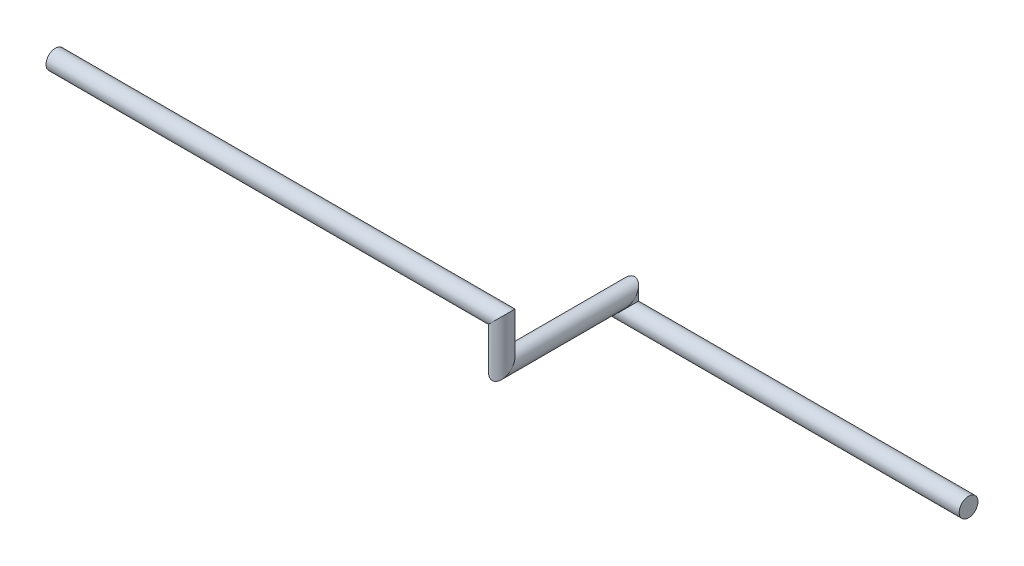
ISO-10303-21;
HEADER;
FILE_DESCRIPTION(('STEP AP214'),'2;1');
FILE_NAME('part.step','',(''),(''),'','','');
FILE_SCHEMA(('AUTOMOTIVE_DESIGN { 1 0 10303 214 1 1 1 1 }'));
ENDSEC;
DATA;
#1=APPLICATION_CONTEXT('core data for automotive mechanical design processes');
#2=APPLICATION_PROTOCOL_DEFINITION('international standard','automotive_design',2000,#1);
#3=PRODUCT_CONTEXT('',#1,'mechanical');
#4=PRODUCT('Part','Part','',(#3));
#5=PRODUCT_RELATED_PRODUCT_CATEGORY('part','',(#4));
#6=PRODUCT_DEFINITION_FORMATION('','',#4);
#7=PRODUCT_DEFINITION_CONTEXT('part definition',#1,'design');
#8=PRODUCT_DEFINITION('design','',#6,#7);
#9=PRODUCT_DEFINITION_SHAPE('','',#8);
#10=(LENGTH_UNIT() NAMED_UNIT(*) SI_UNIT(.MILLI.,.METRE.));
#11=(NAMED_UNIT(*) PLANE_ANGLE_UNIT() SI_UNIT($,.RADIAN.));
#12=(NAMED_UNIT(*) SI_UNIT($,.STERADIAN.) SOLID_ANGLE_UNIT());
#13=UNCERTAINTY_MEASURE_WITH_UNIT(LENGTH_MEASURE(1.E-05),#10,'distance_accuracy_value','');
#14=(GEOMETRIC_REPRESENTATION_CONTEXT(3) GLOBAL_UNCERTAINTY_ASSIGNED_CONTEXT((#13)) GLOBAL_UNIT_ASSIGNED_CONTEXT((#10,
#11,#12)) REPRESENTATION_CONTEXT('',''));
#15=CARTESIAN_POINT('',(0.,0.,0.));
#16=DIRECTION('',(0.,0.,1.));
#17=DIRECTION('',(1.,0.,0.));
#18=AXIS2_PLACEMENT_3D('',#15,#16,#17);
#19=CARTESIAN_POINT('',(-1150.,80.,180.));
#20=DIRECTION('',(1.,0.,0.));
#21=DIRECTION('',(0.,0.,-1.));
#22=AXIS2_PLACEMENT_3D('',#19,#20,#21);
#23=PLANE('',#22);
#24=CARTESIAN_POINT('',(-1150.,80.,180.));
#25=DIRECTION('',(1.,0.,0.));
#26=DIRECTION('',(0.,0.,-1.));
#27=AXIS2_PLACEMENT_3D('',#24,#25,#26);
#28=CIRCLE('',#27,13.7);
#29=CARTESIAN_POINT('',(-1150.,80.,166.3));
#30=VERTEX_POINT('',#29);
#31=EDGE_CURVE('E38',#30,#30,#28,.T.);
#32=ORIENTED_EDGE('',*,*,#31,.F.);
#33=EDGE_LOOP('',(#32));
#34=FACE_BOUND('',#33,.T.);
#35=ADVANCED_FACE('F35',(#34),#23,.F.);
#36=CARTESIAN_POINT('',(0.,0.,0.));
#37=DIRECTION('',(1.,0.,0.));
#38=DIRECTION('',(0.,0.,-1.));
#39=AXIS2_PLACEMENT_3D('',#36,#37,#38);
#40=PLANE('',#39);
#41=CARTESIAN_POINT('',(0.,0.,0.));
#42=DIRECTION('',(1.,0.,0.));
#43=DIRECTION('',(0.,0.,-1.));
#44=AXIS2_PLACEMENT_3D('',#41,#42,#43);
#45=CIRCLE('',#44,13.7);
#46=CARTESIAN_POINT('',(0.,0.,-13.7));
#47=VERTEX_POINT('',#46);
#48=EDGE_CURVE('E43',#47,#47,#45,.T.);
#49=ORIENTED_EDGE('',*,*,#48,.T.);
#50=EDGE_LOOP('',(#49));
#51=FACE_BOUND('',#50,.T.);
#52=ADVANCED_FACE('F86',(#51),#40,.T.);
#53=CARTESIAN_POINT('',(-469.76,80.,180.));
#54=DIRECTION('',(-1.,0.,0.));
#55=DIRECTION('',(0.,0.,1.));
#56=AXIS2_PLACEMENT_3D('',#53,#54,#55);
#57=CYLINDRICAL_SURFACE('',#56,13.7);
#58=CARTESIAN_POINT('',(-500.,80.,180.));
#59=DIRECTION('',(-0.707106781186548,0.707106781186548,0.));
#60=DIRECTION('',(0.707106781186548,0.707106781186548,0.));
#61=AXIS2_PLACEMENT_3D('',#58,#59,#60);
#62=ELLIPSE('',#61,19.3747258045114,13.7);
#63=CARTESIAN_POINT('',(-486.3,93.7,180.));
#64=VERTEX_POINT('',#63);
#65=EDGE_CURVE('E53',#64,#64,#62,.T.);
#66=ORIENTED_EDGE('',*,*,#65,.T.);
#67=EDGE_LOOP('',(#66));
#68=FACE_BOUND('',#67,.T.);
#69=ORIENTED_EDGE('',*,*,#31,.T.);
#70=EDGE_LOOP('',(#69));
#71=FACE_BOUND('',#70,.T.);
#72=ADVANCED_FACE('F83',(#68,#71),#57,.T.);
#73=CARTESIAN_POINT('',(-500.,4.83000000000005,180.));
#74=DIRECTION('',(0.,1.,0.));
#75=DIRECTION('',(0.,0.,1.));
#76=AXIS2_PLACEMENT_3D('',#73,#74,#75);
#77=CYLINDRICAL_SURFACE('',#76,13.7);
#78=CARTESIAN_POINT('',(-500.,20.,180.));
#79=DIRECTION('',(0.,0.707106781186547,0.707106781186547));
#80=DIRECTION('',(0.,-0.707106781186548,0.707106781186548));
#81=AXIS2_PLACEMENT_3D('',#78,#79,#80);
#82=ELLIPSE('',#81,19.3747258045114,13.7);
#83=CARTESIAN_POINT('',(-500.,6.29999999999999,193.7));
#84=VERTEX_POINT('',#83);
#85=EDGE_CURVE('E76',#84,#84,#82,.T.);
#86=ORIENTED_EDGE('',*,*,#85,.T.);
#87=EDGE_LOOP('',(#86));
#88=FACE_BOUND('',#87,.T.);
#89=ORIENTED_EDGE('',*,*,#65,.F.);
#90=EDGE_LOOP('',(#89));
#91=FACE_BOUND('',#90,.T.);
#92=ADVANCED_FACE('F85',(#88,#91),#77,.T.);
#93=CARTESIAN_POINT('',(-500.,20.,-15.17));
#94=DIRECTION('',(0.,0.,1.));
#95=DIRECTION('',(1.,0.,0.));
#96=AXIS2_PLACEMENT_3D('',#93,#94,#95);
#97=CYLINDRICAL_SURFACE('',#96,13.7);
#98=CARTESIAN_POINT('',(-500.,20.,0.));
#99=DIRECTION('',(0.,0.707106781186547,0.707106781186547));
#100=DIRECTION('',(0.,0.707106781186548,-0.707106781186548));
#101=AXIS2_PLACEMENT_3D('',#98,#99,#100);
#102=ELLIPSE('',#101,19.3747258045114,13.7);
#103=CARTESIAN_POINT('',(-500.,33.7,-13.7));
#104=VERTEX_POINT('',#103);
#105=EDGE_CURVE('E74',#104,#104,#102,.T.);
#106=ORIENTED_EDGE('',*,*,#105,.T.);
#107=EDGE_LOOP('',(#106));
#108=FACE_BOUND('',#107,.T.);
#109=ORIENTED_EDGE('',*,*,#85,.F.);
#110=EDGE_LOOP('',(#109));
#111=FACE_BOUND('',#110,.T.);
#112=ADVANCED_FACE('F71',(#108,#111),#97,.T.);
#113=CARTESIAN_POINT('',(-500.,-30.24,0.));
#114=DIRECTION('',(0.,1.,0.));
#115=DIRECTION('',(0.,0.,1.));
#116=AXIS2_PLACEMENT_3D('',#113,#114,#115);
#117=CYLINDRICAL_SURFACE('',#116,13.7);
#118=CARTESIAN_POINT('',(-500.,0.,0.));
#119=DIRECTION('',(-0.707106781186547,0.707106781186547,0.));
#120=DIRECTION('',(-0.707106781186548,-0.707106781186548,0.));
#121=AXIS2_PLACEMENT_3D('',#118,#119,#120);
#122=ELLIPSE('',#121,19.3747258045114,13.7);
#123=CARTESIAN_POINT('',(-513.7,-13.7,0.));
#124=VERTEX_POINT('',#123);
#125=EDGE_CURVE('E11',#124,#124,#122,.T.);
#126=ORIENTED_EDGE('',*,*,#125,.T.);
#127=EDGE_LOOP('',(#126));
#128=FACE_BOUND('',#127,.T.);
#129=ORIENTED_EDGE('',*,*,#105,.F.);
#130=EDGE_LOOP('',(#129));
#131=FACE_BOUND('',#130,.T.);
#132=ADVANCED_FACE('F68',(#128,#131),#117,.T.);
#133=CARTESIAN_POINT('',(0.,0.,0.));
#134=DIRECTION('',(-1.,0.,0.));
#135=DIRECTION('',(0.,0.,1.));
#136=AXIS2_PLACEMENT_3D('',#133,#134,#135);
#137=CYLINDRICAL_SURFACE('',#136,13.7);
#138=ORIENTED_EDGE('',*,*,#48,.F.);
#139=EDGE_LOOP('',(#138));
#140=FACE_BOUND('',#139,.T.);
#141=ORIENTED_EDGE('',*,*,#125,.F.);
#142=EDGE_LOOP('',(#141));
#143=FACE_BOUND('',#142,.T.);
#144=ADVANCED_FACE('F66',(#140,#143),#137,.T.);
#145=CLOSED_SHELL('',(#35,#52,#72,#92,#112,#132,#144));
#146=MANIFOLD_SOLID_BREP('B2',#145);
#147=ADVANCED_BREP_SHAPE_REPRESENTATION('',(#18,#146),#14);
#148=SHAPE_DEFINITION_REPRESENTATION(#9,#147);
ENDSEC;
END-ISO-10303-21;
